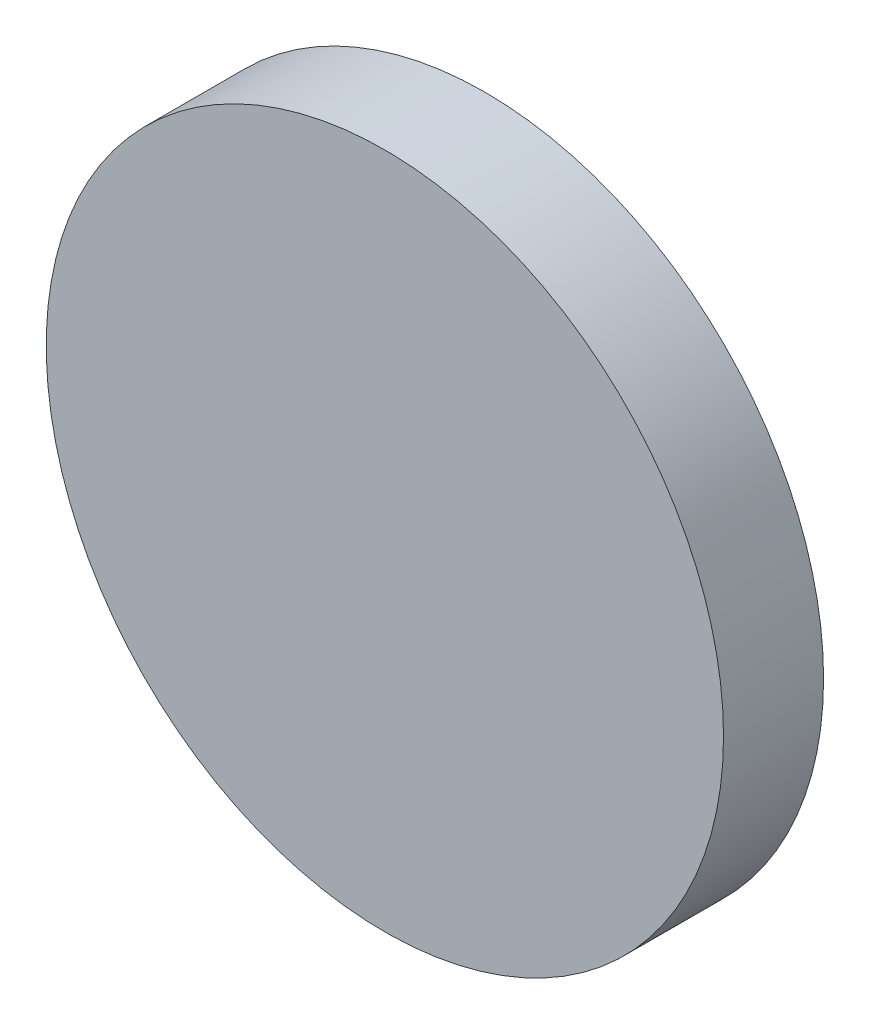
ISO-10303-21;
HEADER;
FILE_DESCRIPTION(('STEP AP214'),'2;1');
FILE_NAME('part.step','',(''),(''),'','','');
FILE_SCHEMA(('AUTOMOTIVE_DESIGN { 1 0 10303 214 1 1 1 1 }'));
ENDSEC;
DATA;
#1=APPLICATION_CONTEXT('core data for automotive mechanical design processes');
#2=APPLICATION_PROTOCOL_DEFINITION('international standard','automotive_design',2000,#1);
#3=PRODUCT_CONTEXT('',#1,'mechanical');
#4=PRODUCT('Part','Part','',(#3));
#5=PRODUCT_RELATED_PRODUCT_CATEGORY('part','',(#4));
#6=PRODUCT_DEFINITION_FORMATION('','',#4);
#7=PRODUCT_DEFINITION_CONTEXT('part definition',#1,'design');
#8=PRODUCT_DEFINITION('design','',#6,#7);
#9=PRODUCT_DEFINITION_SHAPE('','',#8);
#10=(LENGTH_UNIT() NAMED_UNIT(*) SI_UNIT(.MILLI.,.METRE.));
#11=(NAMED_UNIT(*) PLANE_ANGLE_UNIT() SI_UNIT($,.RADIAN.));
#12=(NAMED_UNIT(*) SI_UNIT($,.STERADIAN.) SOLID_ANGLE_UNIT());
#13=UNCERTAINTY_MEASURE_WITH_UNIT(LENGTH_MEASURE(1.E-05),#10,'distance_accuracy_value','');
#14=(GEOMETRIC_REPRESENTATION_CONTEXT(3) GLOBAL_UNCERTAINTY_ASSIGNED_CONTEXT((#13)) GLOBAL_UNIT_ASSIGNED_CONTEXT((#10,
#11,#12)) REPRESENTATION_CONTEXT('',''));
#15=CARTESIAN_POINT('',(0.,0.,0.));
#16=DIRECTION('',(0.,0.,1.));
#17=DIRECTION('',(1.,0.,0.));
#18=AXIS2_PLACEMENT_3D('',#15,#16,#17);
#19=CARTESIAN_POINT('',(0.,26.112,6.));
#20=DIRECTION('',(0.,0.,1.));
#21=DIRECTION('',(1.,0.,0.));
#22=AXIS2_PLACEMENT_3D('',#19,#20,#21);
#23=PLANE('',#22);
#24=CARTESIAN_POINT('',(0.,0.,6.));
#25=DIRECTION('',(0.,0.,1.));
#26=DIRECTION('',(1.,0.,0.));
#27=AXIS2_PLACEMENT_3D('',#24,#25,#26);
#28=CIRCLE('',#27,12.7);
#29=CARTESIAN_POINT('',(12.7,0.,6.));
#30=VERTEX_POINT('',#29);
#31=EDGE_CURVE('E19',#30,#30,#28,.F.);
#32=ORIENTED_EDGE('',*,*,#31,.F.);
#33=EDGE_LOOP('',(#32));
#34=FACE_BOUND('',#33,.T.);
#35=ADVANCED_FACE('F16',(#34),#23,.T.);
#36=CARTESIAN_POINT('',(0.,0.,2.2472692232394));
#37=DIRECTION('',(0.,0.,1.));
#38=DIRECTION('',(1.,0.,0.));
#39=AXIS2_PLACEMENT_3D('',#36,#37,#38);
#40=CYLINDRICAL_SURFACE('',#39,12.7);
#41=ORIENTED_EDGE('',*,*,#31,.T.);
#42=EDGE_LOOP('',(#41));
#43=FACE_BOUND('',#42,.T.);
#44=CARTESIAN_POINT('',(0.,0.,2.2472692232394));
#45=DIRECTION('',(0.,0.,-1.));
#46=DIRECTION('',(-1.,0.,0.));
#47=AXIS2_PLACEMENT_3D('',#44,#45,#46);
#48=CIRCLE('',#47,12.7);
#49=CARTESIAN_POINT('',(-12.7,0.,2.2472692232394));
#50=VERTEX_POINT('',#49);
#51=EDGE_CURVE('E10',#50,#50,#48,.T.);
#52=ORIENTED_EDGE('',*,*,#51,.F.);
#53=EDGE_LOOP('',(#52));
#54=FACE_BOUND('',#53,.T.);
#55=ADVANCED_FACE('F27',(#43,#54),#40,.T.);
#56=CARTESIAN_POINT('',(0.,12.7,2.2472692232394));
#57=CARTESIAN_POINT('',(-12.7,12.7,2.2472692232394));
#58=CARTESIAN_POINT('',(-12.7,0.,2.2472692232394));
#59=CARTESIAN_POINT('',(-12.7,-12.7,2.2472692232394));
#60=CARTESIAN_POINT('',(0.,-12.7,2.2472692232394));
#61=CARTESIAN_POINT('',(12.7,-12.7,2.2472692232394));
#62=CARTESIAN_POINT('',(12.7,0.,2.2472692232394));
#63=CARTESIAN_POINT('',(12.7,12.7,2.2472692232394));
#64=CARTESIAN_POINT('',(0.,12.7,2.2472692232394));
#65=CARTESIAN_POINT('',(0.,12.0006201718352,2.00551567994381));
#66=CARTESIAN_POINT('',(-12.0006201718352,12.0006201718352,2.00551567994381));
#67=CARTESIAN_POINT('',(-12.0006201718352,0.,2.00551567994381));
#68=CARTESIAN_POINT('',(-12.0006201718352,-12.0006201718352,2.00551567994381));
#69=CARTESIAN_POINT('',(0.,-12.0006201718352,2.00551567994381));
#70=CARTESIAN_POINT('',(12.0006201718352,-12.0006201718352,2.00551567994381));
#71=CARTESIAN_POINT('',(12.0006201718352,0.,2.00551567994381));
#72=CARTESIAN_POINT('',(12.0006201718352,12.0006201718352,2.00551567994381));
#73=CARTESIAN_POINT('',(0.,12.0006201718352,2.00551567994381));
#74=CARTESIAN_POINT('',(0.,11.1208820716636,1.72397760996781));
#75=CARTESIAN_POINT('',(-11.1208820716636,11.1208820716636,1.72397760996781));
#76=CARTESIAN_POINT('',(-11.1208820716636,0.,1.72397760996781));
#77=CARTESIAN_POINT('',(-11.1208820716636,-11.1208820716636,1.72397760996781));
#78=CARTESIAN_POINT('',(0.,-11.1208820716636,1.72397760996781));
#79=CARTESIAN_POINT('',(11.1208820716636,-11.1208820716636,1.72397760996781));
#80=CARTESIAN_POINT('',(11.1208820716636,0.,1.72397760996781));
#81=CARTESIAN_POINT('',(11.1208820716636,11.1208820716636,1.72397760996781));
#82=CARTESIAN_POINT('',(0.,11.1208820716636,1.72397760996781));
#83=CARTESIAN_POINT('',(0.,9.88175364168827,1.37021445341033));
#84=CARTESIAN_POINT('',(-9.88175364168827,9.88175364168827,1.37021445341033));
#85=CARTESIAN_POINT('',(-9.88175364168827,0.,1.37021445341033));
#86=CARTESIAN_POINT('',(-9.88175364168827,-9.88175364168827,1.37021445341033));
#87=CARTESIAN_POINT('',(0.,-9.88175364168827,1.37021445341033));
#88=CARTESIAN_POINT('',(9.88175364168827,-9.88175364168827,1.37021445341033));
#89=CARTESIAN_POINT('',(9.88175364168827,0.,1.37021445341033));
#90=CARTESIAN_POINT('',(9.88175364168827,9.88175364168827,1.37021445341033));
#91=CARTESIAN_POINT('',(0.,9.88175364168827,1.37021445341033));
#92=CARTESIAN_POINT('',(0.,9.1761394768433,1.1833238896705));
#93=CARTESIAN_POINT('',(-9.1761394768433,9.1761394768433,1.1833238896705));
#94=CARTESIAN_POINT('',(-9.1761394768433,0.,1.1833238896705));
#95=CARTESIAN_POINT('',(-9.1761394768433,-9.1761394768433,1.1833238896705));
#96=CARTESIAN_POINT('',(0.,-9.1761394768433,1.1833238896705));
#97=CARTESIAN_POINT('',(9.17613947684329,-9.1761394768433,1.1833238896705));
#98=CARTESIAN_POINT('',(9.1761394768433,0.,1.1833238896705));
#99=CARTESIAN_POINT('',(9.1761394768433,9.17613947684329,1.1833238896705));
#100=CARTESIAN_POINT('',(0.,9.1761394768433,1.1833238896705));
#101=CARTESIAN_POINT('',(0.,8.29378756270036,0.968294974451717));
#102=CARTESIAN_POINT('',(-8.29378756270036,8.29378756270036,0.968294974451717));
#103=CARTESIAN_POINT('',(-8.29378756270036,0.,0.968294974451717));
#104=CARTESIAN_POINT('',(-8.29378756270037,-8.29378756270036,0.968294974451717));
#105=CARTESIAN_POINT('',(0.,-8.29378756270036,0.968294974451717));
#106=CARTESIAN_POINT('',(8.29378756270036,-8.29378756270037,0.968294974451717));
#107=CARTESIAN_POINT('',(8.29378756270036,0.,0.968294974451717));
#108=CARTESIAN_POINT('',(8.29378756270037,8.29378756270036,0.968294974451717));
#109=CARTESIAN_POINT('',(0.,8.29378756270036,0.968294974451717));
#110=CARTESIAN_POINT('',(0.,7.58814435835275,0.811291642008879));
#111=CARTESIAN_POINT('',(-7.58814435835275,7.58814435835275,0.811291642008879));
#112=CARTESIAN_POINT('',(-7.58814435835275,0.,0.811291642008879));
#113=CARTESIAN_POINT('',(-7.58814435835275,-7.58814435835275,0.811291642008879));
#114=CARTESIAN_POINT('',(0.,-7.58814435835275,0.811291642008879));
#115=CARTESIAN_POINT('',(7.58814435835275,-7.58814435835275,0.811291642008879));
#116=CARTESIAN_POINT('',(7.58814435835275,0.,0.811291642008879));
#117=CARTESIAN_POINT('',(7.58814435835275,7.58814435835275,0.811291642008879));
#118=CARTESIAN_POINT('',(0.,7.58814435835275,0.811291642008879));
#119=CARTESIAN_POINT('',(0.,6.70573061736845,0.634065967380735));
#120=CARTESIAN_POINT('',(-6.70573061736845,6.70573061736845,0.634065967380735));
#121=CARTESIAN_POINT('',(-6.70573061736845,0.,0.634065967380735));
#122=CARTESIAN_POINT('',(-6.70573061736845,-6.70573061736845,0.634065967380735));
#123=CARTESIAN_POINT('',(0.,-6.70573061736845,0.634065967380735));
#124=CARTESIAN_POINT('',(6.70573061736845,-6.70573061736845,0.634065967380735));
#125=CARTESIAN_POINT('',(6.70573061736845,0.,0.634065967380735));
#126=CARTESIAN_POINT('',(6.70573061736845,6.70573061736845,0.634065967380735));
#127=CARTESIAN_POINT('',(0.,6.70573061736845,0.634065967380735));
#128=CARTESIAN_POINT('',(0.,6.00005995829104,0.507636719754635));
#129=CARTESIAN_POINT('',(-6.00005995829104,6.00005995829104,0.507636719754635));
#130=CARTESIAN_POINT('',(-6.00005995829104,0.,0.507636719754635));
#131=CARTESIAN_POINT('',(-6.00005995829104,-6.00005995829104,0.507636719754635));
#132=CARTESIAN_POINT('',(0.,-6.00005995829104,0.507636719754635));
#133=CARTESIAN_POINT('',(6.00005995829104,-6.00005995829104,0.507636719754635));
#134=CARTESIAN_POINT('',(6.00005995829104,0.,0.507636719754635));
#135=CARTESIAN_POINT('',(6.00005995829104,6.00005995829104,0.507636719754635));
#136=CARTESIAN_POINT('',(0.,6.00005995829104,0.507636719754635));
#137=CARTESIAN_POINT('',(0.,5.11759324883389,0.368989252125664));
#138=CARTESIAN_POINT('',(-5.11759324883389,5.11759324883389,0.368989252125664));
#139=CARTESIAN_POINT('',(-5.11759324883389,0.,0.368989252125664));
#140=CARTESIAN_POINT('',(-5.1175932488339,-5.11759324883389,0.368989252125664));
#141=CARTESIAN_POINT('',(0.,-5.11759324883389,0.368989252125664));
#142=CARTESIAN_POINT('',(5.11759324883389,-5.1175932488339,0.368989252125664));
#143=CARTESIAN_POINT('',(5.11759324883389,0.,0.368989252125664));
#144=CARTESIAN_POINT('',(5.1175932488339,5.11759324883389,0.368989252125664));
#145=CARTESIAN_POINT('',(0.,5.11759324883389,0.368989252125664));
#146=CARTESIAN_POINT('',(0.,4.41189910531564,0.273684688003095));
#147=CARTESIAN_POINT('',(-4.41189910531564,4.41189910531564,0.273684688003095));
#148=CARTESIAN_POINT('',(-4.41189910531564,0.,0.273684688003095));
#149=CARTESIAN_POINT('',(-4.41189910531564,-4.41189910531564,0.273684688003095));
#150=CARTESIAN_POINT('',(0.,-4.41189910531564,0.273684688003095));
#151=CARTESIAN_POINT('',(4.41189910531564,-4.41189910531565,0.273684688003095));
#152=CARTESIAN_POINT('',(4.41189910531564,0.,0.273684688003095));
#153=CARTESIAN_POINT('',(4.41189910531565,4.41189910531564,0.273684688003095));
#154=CARTESIAN_POINT('',(0.,4.41189910531564,0.273684688003095));
#155=CARTESIAN_POINT('',(0.,3.52939107097286,0.174218993254236));
#156=CARTESIAN_POINT('',(-3.52939107097286,3.52939107097286,0.174218993254236));
#157=CARTESIAN_POINT('',(-3.52939107097286,0.,0.174218993254236));
#158=CARTESIAN_POINT('',(-3.52939107097286,-3.52939107097286,0.174218993254236));
#159=CARTESIAN_POINT('',(0.,-3.52939107097286,0.174218993254236));
#160=CARTESIAN_POINT('',(3.52939107097286,-3.52939107097286,0.174218993254236));
#161=CARTESIAN_POINT('',(3.52939107097286,0.,0.174218993254236));
#162=CARTESIAN_POINT('',(3.52939107097286,3.52939107097286,0.174218993254236));
#163=CARTESIAN_POINT('',(0.,3.52939107097286,0.174218993254236));
#164=CARTESIAN_POINT('',(0.,2.82367680946581,0.110452615718366));
#165=CARTESIAN_POINT('',(-2.82367680946581,2.82367680946581,0.110452615718366));
#166=CARTESIAN_POINT('',(-2.82367680946581,0.,0.110452615718366));
#167=CARTESIAN_POINT('',(-2.82367680946581,-2.82367680946581,0.110452615718366));
#168=CARTESIAN_POINT('',(0.,-2.82367680946581,0.110452615718366));
#169=CARTESIAN_POINT('',(2.82367680946581,-2.82367680946581,0.110452615718366));
#170=CARTESIAN_POINT('',(2.82367680946581,0.,0.110452615718366));
#171=CARTESIAN_POINT('',(2.82367680946581,2.82367680946581,0.110452615718366));
#172=CARTESIAN_POINT('',(0.,2.82367680946581,0.110452615718366));
#173=CARTESIAN_POINT('',(0.,1.85311205791171,0.0446297176160865));
#174=CARTESIAN_POINT('',(-1.85311205791171,1.85311205791171,0.0446297176160865));
#175=CARTESIAN_POINT('',(-1.85311205791171,0.,0.0446297176160865));
#176=CARTESIAN_POINT('',(-1.85311205791171,-1.85311205791171,0.0446297176160865));
#177=CARTESIAN_POINT('',(0.,-1.85311205791171,0.0446297176160865));
#178=CARTESIAN_POINT('',(1.85311205791171,-1.85311205791171,0.0446297176160865));
#179=CARTESIAN_POINT('',(1.85311205791171,0.,0.0446297176160865));
#180=CARTESIAN_POINT('',(1.85311205791171,1.85311205791171,0.0446297176160865));
#181=CARTESIAN_POINT('',(0.,1.85311205791171,0.0446297176160865));
#182=CARTESIAN_POINT('',(0.,0.970950738355021,0.00799684688274094));
#183=CARTESIAN_POINT('',(-0.970950738355021,0.970950738355021,0.00799684688274094));
#184=CARTESIAN_POINT('',(-0.970950738355021,0.,0.00799684688274094));
#185=CARTESIAN_POINT('',(-0.970950738355021,-0.970950738355021,0.00799684688274094));
#186=CARTESIAN_POINT('',(0.,-0.970950738355021,0.00799684688274094));
#187=CARTESIAN_POINT('',(0.970950738355021,-0.970950738355021,0.00799684688274094));
#188=CARTESIAN_POINT('',(0.970950738355021,0.,0.00799684688274094));
#189=CARTESIAN_POINT('',(0.970950738355021,0.97095073835502,0.00799684688274094));
#190=CARTESIAN_POINT('',(0.,0.970950738355021,0.00799684688274094));
#191=CARTESIAN_POINT('',(0.,0.264651045122554,0.));
#192=CARTESIAN_POINT('',(-0.264651045122554,0.264651045122554,0.));
#193=CARTESIAN_POINT('',(-0.264651045122554,0.,0.));
#194=CARTESIAN_POINT('',(-0.264651045122554,-0.264651045122554,0.));
#195=CARTESIAN_POINT('',(0.,-0.264651045122554,0.));
#196=CARTESIAN_POINT('',(0.264651045122554,-0.264651045122554,0.));
#197=CARTESIAN_POINT('',(0.264651045122554,0.,0.));
#198=CARTESIAN_POINT('',(0.264651045122554,0.264651045122554,0.));
#199=CARTESIAN_POINT('',(0.,0.264651045122554,0.));
#200=CARTESIAN_POINT('',(0.,0.,0.));
#201=CARTESIAN_POINT('',(0.,0.,0.));
#202=CARTESIAN_POINT('',(0.,0.,0.));
#203=CARTESIAN_POINT('',(0.,0.,0.));
#204=CARTESIAN_POINT('',(0.,0.,0.));
#205=CARTESIAN_POINT('',(0.,0.,0.));
#206=CARTESIAN_POINT('',(0.,0.,0.));
#207=CARTESIAN_POINT('',(0.,0.,0.));
#208=CARTESIAN_POINT('',(0.,0.,0.));
#209=(BOUNDED_SURFACE() B_SPLINE_SURFACE(3,2,((#56,#57,#58,#59,#60,#61,#62,#63,#64),(#65,#66,
#67,#68,#69,#70,#71,#72,#73),(#74,#75,#76,#77,#78,#79,#80,#81,#82),(#83,#84,#85,#86,#87,#88,#89,
#90,#91),(#92,#93,#94,#95,#96,#97,#98,#99,#100),(#101,#102,#103,#104,#105,#106,#107,#108,#109),
(#110,#111,#112,#113,#114,#115,#116,#117,#118),(#119,#120,#121,#122,#123,#124,#125,#126,#127),
(#128,#129,#130,#131,#132,#133,#134,#135,#136),(#137,#138,#139,#140,#141,#142,#143,#144,#145),
(#146,#147,#148,#149,#150,#151,#152,#153,#154),(#155,#156,#157,#158,#159,#160,#161,#162,#163),
(#164,#165,#166,#167,#168,#169,#170,#171,#172),(#173,#174,#175,#176,#177,#178,#179,#180,#181),
(#182,#183,#184,#185,#186,#187,#188,#189,#190),(#191,#192,#193,#194,#195,#196,#197,#198,#199),
(#200,#201,#202,#203,#204,#205,#206,#207,#208)),.UNSPECIFIED.,.F.,.T.,
.F.) B_SPLINE_SURFACE_WITH_KNOTS((4,1,1,1,1,1,1,1,1,1,1,1,1,1,4),(3,2,2,2,3),(0.,
0.171330343396877,0.213800222055674,0.29830384029435,0.340337579874228,0.424025726424225,
0.465680133394342,0.548674709641423,0.590014878918386,0.672453069883103,0.713551091570857,
0.79558255296048,0.836515992662349,0.938724716182109,1.),(0.,90.,180.,270.,360.),
.UNSPECIFIED.) GEOMETRIC_REPRESENTATION_ITEM() RATIONAL_B_SPLINE_SURFACE(((1.,0.707106781186548,
1.,0.707106781186548,1.,0.707106781186548,1.,0.707106781186548,1.),(1.,0.707106781186548,1.,
0.707106781186548,1.,0.707106781186548,1.,0.707106781186548,1.),(1.,0.707106781186548,1.,
0.707106781186548,1.,0.707106781186548,1.,0.707106781186548,1.),(1.,0.707106781186548,1.,
0.707106781186548,1.,0.707106781186548,1.,0.707106781186548,1.),(1.,0.707106781186548,1.,
0.707106781186548,1.,0.707106781186548,1.,0.707106781186548,1.),(1.,0.707106781186548,1.,
0.707106781186548,1.,0.707106781186548,1.,0.707106781186548,1.),(1.,0.707106781186548,1.,
0.707106781186548,1.,0.707106781186548,1.,0.707106781186548,1.),(1.,0.707106781186548,1.,
0.707106781186548,1.,0.707106781186548,1.,0.707106781186548,1.),(1.,0.707106781186548,1.,
0.707106781186548,1.,0.707106781186548,1.,0.707106781186548,1.),(1.,0.707106781186548,1.,
0.707106781186548,1.,0.707106781186548,1.,0.707106781186548,1.),(1.,0.707106781186548,1.,
0.707106781186548,1.,0.707106781186548,1.,0.707106781186548,1.),(1.,0.707106781186548,1.,
0.707106781186548,1.,0.707106781186548,1.,0.707106781186548,1.),(1.,0.707106781186548,1.,
0.707106781186548,1.,0.707106781186548,1.,0.707106781186548,1.),(1.,0.707106781186548,1.,
0.707106781186548,1.,0.707106781186548,1.,0.707106781186548,1.),(1.,0.707106781186548,1.,
0.707106781186548,1.,0.707106781186548,1.,0.707106781186548,1.),(1.,0.707106781186548,1.,
0.707106781186548,1.,0.707106781186548,1.,0.707106781186548,1.),(1.,0.707106781186548,1.,
0.707106781186548,1.,0.707106781186548,1.,0.707106781186548,1.))) REPRESENTATION_ITEM('') SURFACE());
#210=ORIENTED_EDGE('',*,*,#51,.T.);
#211=EDGE_LOOP('',(#210));
#212=FACE_BOUND('',#211,.T.);
#213=CARTESIAN_POINT('',(0.,0.,0.));
#214=VERTEX_POINT('',#213);
#215=VERTEX_LOOP('',#214);
#216=FACE_BOUND('',#215,.T.);
#217=ADVANCED_FACE('F25',(#212,#216),#209,.T.);
#218=CLOSED_SHELL('',(#35,#55,#217));
#219=MANIFOLD_SOLID_BREP('B1',#218);
#220=ADVANCED_BREP_SHAPE_REPRESENTATION('',(#18,#219),#14);
#221=SHAPE_DEFINITION_REPRESENTATION(#9,#220);
ENDSEC;
END-ISO-10303-21;
